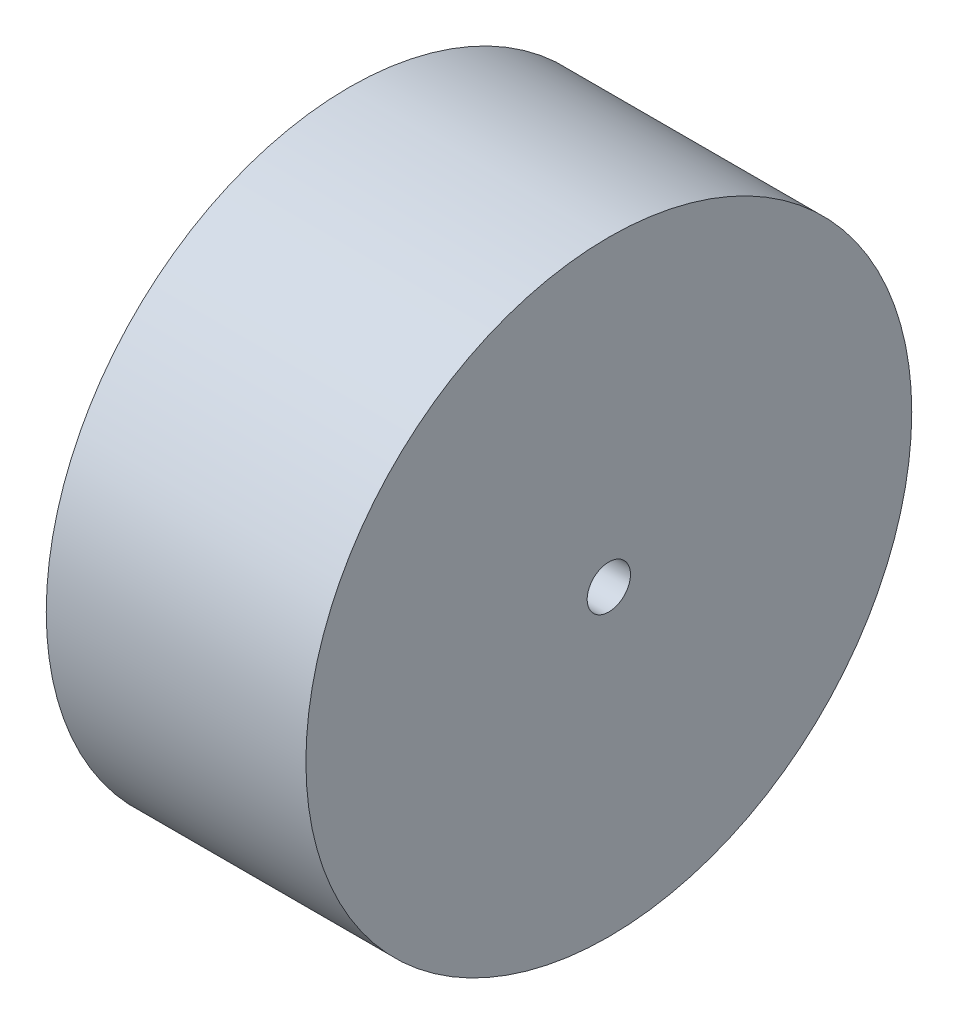
ISO-10303-21;
HEADER;
FILE_DESCRIPTION(('STEP AP214'),'2;1');
FILE_NAME('part.step','',(''),(''),'','','');
FILE_SCHEMA(('AUTOMOTIVE_DESIGN { 1 0 10303 214 1 1 1 1 }'));
ENDSEC;
DATA;
#1=APPLICATION_CONTEXT('core data for automotive mechanical design processes');
#2=APPLICATION_PROTOCOL_DEFINITION('international standard','automotive_design',2000,#1);
#3=PRODUCT_CONTEXT('',#1,'mechanical');
#4=PRODUCT('Part','Part','',(#3));
#5=PRODUCT_RELATED_PRODUCT_CATEGORY('part','',(#4));
#6=PRODUCT_DEFINITION_FORMATION('','',#4);
#7=PRODUCT_DEFINITION_CONTEXT('part definition',#1,'design');
#8=PRODUCT_DEFINITION('design','',#6,#7);
#9=PRODUCT_DEFINITION_SHAPE('','',#8);
#10=(LENGTH_UNIT() NAMED_UNIT(*) SI_UNIT(.MILLI.,.METRE.));
#11=(NAMED_UNIT(*) PLANE_ANGLE_UNIT() SI_UNIT($,.RADIAN.));
#12=(NAMED_UNIT(*) SI_UNIT($,.STERADIAN.) SOLID_ANGLE_UNIT());
#13=UNCERTAINTY_MEASURE_WITH_UNIT(LENGTH_MEASURE(1.E-05),#10,'distance_accuracy_value','');
#14=(GEOMETRIC_REPRESENTATION_CONTEXT(3) GLOBAL_UNCERTAINTY_ASSIGNED_CONTEXT((#13)) GLOBAL_UNIT_ASSIGNED_CONTEXT((#10,
#11,#12)) REPRESENTATION_CONTEXT('',''));
#15=CARTESIAN_POINT('',(0.,0.,0.));
#16=DIRECTION('',(0.,0.,1.));
#17=DIRECTION('',(1.,0.,0.));
#18=AXIS2_PLACEMENT_3D('',#15,#16,#17);
#19=CARTESIAN_POINT('',(30.,0.,0.));
#20=DIRECTION('',(1.,0.,0.));
#21=DIRECTION('',(0.,0.,-1.));
#22=AXIS2_PLACEMENT_3D('',#19,#20,#21);
#23=PLANE('',#22);
#24=CARTESIAN_POINT('',(30.,0.,0.));
#25=DIRECTION('',(1.,0.,0.));
#26=DIRECTION('',(0.,0.,-1.));
#27=AXIS2_PLACEMENT_3D('',#24,#25,#26);
#28=CIRCLE('',#27,35.);
#29=CARTESIAN_POINT('',(30.,0.,-35.));
#30=VERTEX_POINT('',#29);
#31=EDGE_CURVE('E10',#30,#30,#28,.T.);
#32=ORIENTED_EDGE('',*,*,#31,.T.);
#33=EDGE_LOOP('',(#32));
#34=FACE_BOUND('',#33,.T.);
#35=CARTESIAN_POINT('',(30.,0.,0.));
#36=DIRECTION('',(1.,0.,0.));
#37=DIRECTION('',(0.,0.,-1.));
#38=AXIS2_PLACEMENT_3D('',#35,#36,#37);
#39=CIRCLE('',#38,2.5);
#40=CARTESIAN_POINT('',(30.,0.,-2.5));
#41=VERTEX_POINT('',#40);
#42=EDGE_CURVE('E44',#41,#41,#39,.T.);
#43=ORIENTED_EDGE('',*,*,#42,.F.);
#44=EDGE_LOOP('',(#43));
#45=FACE_BOUND('',#44,.T.);
#46=ADVANCED_FACE('F33',(#34,#45),#23,.T.);
#47=CARTESIAN_POINT('',(0.,0.,0.));
#48=DIRECTION('',(1.,0.,0.));
#49=DIRECTION('',(0.,0.,-1.));
#50=AXIS2_PLACEMENT_3D('',#47,#48,#49);
#51=PLANE('',#50);
#52=CARTESIAN_POINT('',(0.,0.,0.));
#53=DIRECTION('',(1.,0.,0.));
#54=DIRECTION('',(0.,0.,-1.));
#55=AXIS2_PLACEMENT_3D('',#52,#53,#54);
#56=CIRCLE('',#55,35.);
#57=CARTESIAN_POINT('',(0.,0.,-35.));
#58=VERTEX_POINT('',#57);
#59=EDGE_CURVE('E37',#58,#58,#56,.T.);
#60=ORIENTED_EDGE('',*,*,#59,.F.);
#61=EDGE_LOOP('',(#60));
#62=FACE_BOUND('',#61,.T.);
#63=CARTESIAN_POINT('',(0.,0.,0.));
#64=DIRECTION('',(1.,0.,0.));
#65=DIRECTION('',(0.,0.,-1.));
#66=AXIS2_PLACEMENT_3D('',#63,#64,#65);
#67=CIRCLE('',#66,2.5);
#68=CARTESIAN_POINT('',(0.,0.,-2.5));
#69=VERTEX_POINT('',#68);
#70=EDGE_CURVE('E46',#69,#69,#67,.T.);
#71=ORIENTED_EDGE('',*,*,#70,.T.);
#72=EDGE_LOOP('',(#71));
#73=FACE_BOUND('',#72,.T.);
#74=ADVANCED_FACE('F56',(#62,#73),#51,.F.);
#75=CARTESIAN_POINT('',(30.,0.,0.));
#76=DIRECTION('',(-1.,0.,0.));
#77=DIRECTION('',(0.,0.,1.));
#78=AXIS2_PLACEMENT_3D('',#75,#76,#77);
#79=CYLINDRICAL_SURFACE('',#78,35.);
#80=ORIENTED_EDGE('',*,*,#31,.F.);
#81=EDGE_LOOP('',(#80));
#82=FACE_BOUND('',#81,.T.);
#83=ORIENTED_EDGE('',*,*,#59,.T.);
#84=EDGE_LOOP('',(#83));
#85=FACE_BOUND('',#84,.T.);
#86=ADVANCED_FACE('F35',(#82,#85),#79,.T.);
#87=CARTESIAN_POINT('',(30.,0.,0.));
#88=DIRECTION('',(-1.,0.,0.));
#89=DIRECTION('',(0.,0.,1.));
#90=AXIS2_PLACEMENT_3D('',#87,#88,#89);
#91=CYLINDRICAL_SURFACE('',#90,2.5);
#92=ORIENTED_EDGE('',*,*,#42,.T.);
#93=EDGE_LOOP('',(#92));
#94=FACE_BOUND('',#93,.T.);
#95=ORIENTED_EDGE('',*,*,#70,.F.);
#96=EDGE_LOOP('',(#95));
#97=FACE_BOUND('',#96,.T.);
#98=ADVANCED_FACE('F52',(#94,#97),#91,.F.);
#99=CLOSED_SHELL('',(#46,#74,#86,#98));
#100=MANIFOLD_SOLID_BREP('B2',#99);
#101=ADVANCED_BREP_SHAPE_REPRESENTATION('',(#18,#100),#14);
#102=SHAPE_DEFINITION_REPRESENTATION(#9,#101);
ENDSEC;
END-ISO-10303-21;
